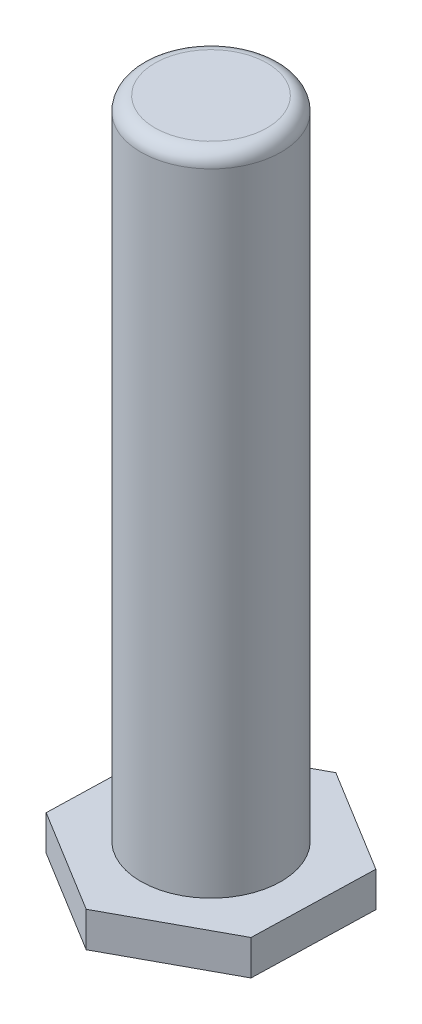
ISO-10303-21;
HEADER;
FILE_DESCRIPTION(('STEP AP214'),'2;1');
FILE_NAME('part.step','',(''),(''),'','','');
FILE_SCHEMA(('AUTOMOTIVE_DESIGN { 1 0 10303 214 1 1 1 1 }'));
ENDSEC;
DATA;
#1=APPLICATION_CONTEXT('core data for automotive mechanical design processes');
#2=APPLICATION_PROTOCOL_DEFINITION('international standard','automotive_design',2000,#1);
#3=PRODUCT_CONTEXT('',#1,'mechanical');
#4=PRODUCT('Part','Part','',(#3));
#5=PRODUCT_RELATED_PRODUCT_CATEGORY('part','',(#4));
#6=PRODUCT_DEFINITION_FORMATION('','',#4);
#7=PRODUCT_DEFINITION_CONTEXT('part definition',#1,'design');
#8=PRODUCT_DEFINITION('design','',#6,#7);
#9=PRODUCT_DEFINITION_SHAPE('','',#8);
#10=(LENGTH_UNIT() NAMED_UNIT(*) SI_UNIT(.MILLI.,.METRE.));
#11=(NAMED_UNIT(*) PLANE_ANGLE_UNIT() SI_UNIT($,.RADIAN.));
#12=(NAMED_UNIT(*) SI_UNIT($,.STERADIAN.) SOLID_ANGLE_UNIT());
#13=UNCERTAINTY_MEASURE_WITH_UNIT(LENGTH_MEASURE(1.E-05),#10,'distance_accuracy_value','');
#14=(GEOMETRIC_REPRESENTATION_CONTEXT(3) GLOBAL_UNCERTAINTY_ASSIGNED_CONTEXT((#13)) GLOBAL_UNIT_ASSIGNED_CONTEXT((#10,
#11,#12)) REPRESENTATION_CONTEXT('',''));
#15=CARTESIAN_POINT('',(0.,0.,0.));
#16=DIRECTION('',(0.,0.,1.));
#17=DIRECTION('',(1.,0.,0.));
#18=AXIS2_PLACEMENT_3D('',#15,#16,#17);
#19=CARTESIAN_POINT('',(0.464078435847936,5.,-17.3205080756888));
#20=DIRECTION('',(0.476625025306334,0.,0.879106697307976));
#21=DIRECTION('',(0.879106697307976,0.,-0.476625025306334));
#22=AXIS2_PLACEMENT_3D('',#19,#20,#21);
#23=PLANE('',#22);
#24=DIRECTION('',(-0.879106697307976,0.,0.476625025306334));
#25=VECTOR('',#24,1.);
#26=CARTESIAN_POINT('',(0.464078435847936,0.,-17.3205080756888));
#27=LINE('',#26,#25);
#28=CARTESIAN_POINT('',(0.464078435847936,0.,-17.3205080756888));
#29=VERTEX_POINT('',#28);
#30=CARTESIAN_POINT('',(-14.767960782076,0.,-9.06215775263725));
#31=VERTEX_POINT('',#30);
#32=EDGE_CURVE('E122',#29,#31,#27,.T.);
#33=ORIENTED_EDGE('',*,*,#32,.T.);
#34=DIRECTION('',(0.,-1.,0.));
#35=VECTOR('',#34,1.);
#36=CARTESIAN_POINT('',(-14.767960782076,5.,-9.06215775263725));
#37=LINE('',#36,#35);
#38=CARTESIAN_POINT('',(-14.767960782076,5.,-9.06215775263725));
#39=VERTEX_POINT('',#38);
#40=EDGE_CURVE('E139',#39,#31,#37,.T.);
#41=ORIENTED_EDGE('',*,*,#40,.F.);
#42=DIRECTION('',(-0.879106697307976,0.,0.476625025306334));
#43=VECTOR('',#42,1.);
#44=CARTESIAN_POINT('',(0.464078435847936,5.,-17.3205080756888));
#45=LINE('',#44,#43);
#46=CARTESIAN_POINT('',(0.464078435847936,5.,-17.3205080756888));
#47=VERTEX_POINT('',#46);
#48=EDGE_CURVE('E132',#47,#39,#45,.T.);
#49=ORIENTED_EDGE('',*,*,#48,.F.);
#50=DIRECTION('',(0.,-1.,0.));
#51=VECTOR('',#50,1.);
#52=CARTESIAN_POINT('',(0.464078435847936,5.,-17.3205080756888));
#53=LINE('',#52,#51);
#54=EDGE_CURVE('E118',#47,#29,#53,.T.);
#55=ORIENTED_EDGE('',*,*,#54,.T.);
#56=EDGE_LOOP('',(#33,#41,#49,#55));
#57=FACE_BOUND('',#56,.T.);
#58=ADVANCED_FACE('F36',(#57),#23,.F.);
#59=CARTESIAN_POINT('',(-14.767960782076,5.,-9.06215775263725));
#60=DIRECTION('',(0.999641245158911,0.,0.0267839686593015));
#61=DIRECTION('',(0.0267839686593015,0.,-0.999641245158911));
#62=AXIS2_PLACEMENT_3D('',#59,#60,#61);
#63=PLANE('',#62);
#64=DIRECTION('',(-0.0267839686593015,0.,0.999641245158911));
#65=VECTOR('',#64,1.);
#66=CARTESIAN_POINT('',(-14.767960782076,0.,-9.06215775263725));
#67=LINE('',#66,#65);
#68=CARTESIAN_POINT('',(-15.232039217924,0.,8.25835032305153));
#69=VERTEX_POINT('',#68);
#70=EDGE_CURVE('E125',#31,#69,#67,.T.);
#71=ORIENTED_EDGE('',*,*,#70,.T.);
#72=DIRECTION('',(0.,-1.,0.));
#73=VECTOR('',#72,1.);
#74=CARTESIAN_POINT('',(-15.232039217924,5.,8.25835032305153));
#75=LINE('',#74,#73);
#76=CARTESIAN_POINT('',(-15.232039217924,5.,8.25835032305153));
#77=VERTEX_POINT('',#76);
#78=EDGE_CURVE('E136',#77,#69,#75,.T.);
#79=ORIENTED_EDGE('',*,*,#78,.F.);
#80=DIRECTION('',(-0.0267839686593015,0.,0.999641245158911));
#81=VECTOR('',#80,1.);
#82=CARTESIAN_POINT('',(-14.767960782076,5.,-9.06215775263725));
#83=LINE('',#82,#81);
#84=EDGE_CURVE('E91',#39,#77,#83,.T.);
#85=ORIENTED_EDGE('',*,*,#84,.F.);
#86=ORIENTED_EDGE('',*,*,#40,.T.);
#87=EDGE_LOOP('',(#71,#79,#85,#86));
#88=FACE_BOUND('',#87,.T.);
#89=ADVANCED_FACE('F152',(#88),#63,.F.);
#90=CARTESIAN_POINT('',(-15.232039217924,5.,8.25835032305153));
#91=DIRECTION('',(0.523016219852577,0.,-0.852322728648674));
#92=DIRECTION('',(-0.852322728648674,0.,-0.523016219852577));
#93=AXIS2_PLACEMENT_3D('',#90,#91,#92);
#94=PLANE('',#93);
#95=DIRECTION('',(0.852322728648674,0.,0.523016219852577));
#96=VECTOR('',#95,1.);
#97=CARTESIAN_POINT('',(-15.232039217924,0.,8.25835032305153));
#98=LINE('',#97,#96);
#99=CARTESIAN_POINT('',(-0.464078435847931,0.,17.3205080756888));
#100=VERTEX_POINT('',#99);
#101=EDGE_CURVE('E127',#69,#100,#98,.T.);
#102=ORIENTED_EDGE('',*,*,#101,.T.);
#103=DIRECTION('',(0.,-1.,0.));
#104=VECTOR('',#103,1.);
#105=CARTESIAN_POINT('',(-0.464078435847931,5.,17.3205080756888));
#106=LINE('',#105,#104);
#107=CARTESIAN_POINT('',(-0.464078435847931,5.,17.3205080756888));
#108=VERTEX_POINT('',#107);
#109=EDGE_CURVE('E113',#108,#100,#106,.T.);
#110=ORIENTED_EDGE('',*,*,#109,.F.);
#111=DIRECTION('',(0.852322728648674,0.,0.523016219852577));
#112=VECTOR('',#111,1.);
#113=CARTESIAN_POINT('',(-15.232039217924,5.,8.25835032305153));
#114=LINE('',#113,#112);
#115=EDGE_CURVE('E104',#77,#108,#114,.T.);
#116=ORIENTED_EDGE('',*,*,#115,.F.);
#117=ORIENTED_EDGE('',*,*,#78,.T.);
#118=EDGE_LOOP('',(#102,#110,#116,#117));
#119=FACE_BOUND('',#118,.T.);
#120=ADVANCED_FACE('F155',(#119),#94,.F.);
#121=CARTESIAN_POINT('',(-0.464078435847931,5.,17.3205080756888));
#122=DIRECTION('',(-0.476625025306334,0.,-0.879106697307976));
#123=DIRECTION('',(-0.879106697307976,0.,0.476625025306334));
#124=AXIS2_PLACEMENT_3D('',#121,#122,#123);
#125=PLANE('',#124);
#126=DIRECTION('',(0.879106697307976,0.,-0.476625025306334));
#127=VECTOR('',#126,1.);
#128=CARTESIAN_POINT('',(-0.464078435847931,0.,17.3205080756888));
#129=LINE('',#128,#127);
#130=CARTESIAN_POINT('',(14.767960782076,0.,9.06215775263725));
#131=VERTEX_POINT('',#130);
#132=EDGE_CURVE('E112',#100,#131,#129,.T.);
#133=ORIENTED_EDGE('',*,*,#132,.T.);
#134=DIRECTION('',(0.,-1.,0.));
#135=VECTOR('',#134,1.);
#136=CARTESIAN_POINT('',(14.767960782076,5.,9.06215775263725));
#137=LINE('',#136,#135);
#138=CARTESIAN_POINT('',(14.767960782076,5.,9.06215775263725));
#139=VERTEX_POINT('',#138);
#140=EDGE_CURVE('E109',#139,#131,#137,.T.);
#141=ORIENTED_EDGE('',*,*,#140,.F.);
#142=DIRECTION('',(0.879106697307976,0.,-0.476625025306334));
#143=VECTOR('',#142,1.);
#144=CARTESIAN_POINT('',(-0.464078435847931,5.,17.3205080756888));
#145=LINE('',#144,#143);
#146=EDGE_CURVE('E98',#108,#139,#145,.T.);
#147=ORIENTED_EDGE('',*,*,#146,.F.);
#148=ORIENTED_EDGE('',*,*,#109,.T.);
#149=EDGE_LOOP('',(#133,#141,#147,#148));
#150=FACE_BOUND('',#149,.T.);
#151=ADVANCED_FACE('F110',(#150),#125,.F.);
#152=CARTESIAN_POINT('',(14.767960782076,5.,9.06215775263725));
#153=DIRECTION('',(-0.999641245158911,0.,-0.0267839686593015));
#154=DIRECTION('',(-0.0267839686593015,0.,0.999641245158911));
#155=AXIS2_PLACEMENT_3D('',#152,#153,#154);
#156=PLANE('',#155);
#157=DIRECTION('',(0.0267839686593015,0.,-0.999641245158911));
#158=VECTOR('',#157,1.);
#159=CARTESIAN_POINT('',(14.767960782076,0.,9.06215775263725));
#160=LINE('',#159,#158);
#161=CARTESIAN_POINT('',(15.232039217924,0.,-8.25835032305153));
#162=VERTEX_POINT('',#161);
#163=EDGE_CURVE('E76',#131,#162,#160,.T.);
#164=ORIENTED_EDGE('',*,*,#163,.T.);
#165=DIRECTION('',(0.,-1.,0.));
#166=VECTOR('',#165,1.);
#167=CARTESIAN_POINT('',(15.232039217924,5.,-8.25835032305153));
#168=LINE('',#167,#166);
#169=CARTESIAN_POINT('',(15.232039217924,5.,-8.25835032305153));
#170=VERTEX_POINT('',#169);
#171=EDGE_CURVE('E114',#170,#162,#168,.T.);
#172=ORIENTED_EDGE('',*,*,#171,.F.);
#173=DIRECTION('',(0.0267839686593015,0.,-0.999641245158911));
#174=VECTOR('',#173,1.);
#175=CARTESIAN_POINT('',(14.767960782076,5.,9.06215775263725));
#176=LINE('',#175,#174);
#177=EDGE_CURVE('E102',#139,#170,#176,.T.);
#178=ORIENTED_EDGE('',*,*,#177,.F.);
#179=ORIENTED_EDGE('',*,*,#140,.T.);
#180=EDGE_LOOP('',(#164,#172,#178,#179));
#181=FACE_BOUND('',#180,.T.);
#182=ADVANCED_FACE('F116',(#181),#156,.F.);
#183=CARTESIAN_POINT('',(15.232039217924,5.,-8.25835032305153));
#184=DIRECTION('',(-0.523016219852577,0.,0.852322728648674));
#185=DIRECTION('',(0.852322728648674,0.,0.523016219852577));
#186=AXIS2_PLACEMENT_3D('',#183,#184,#185);
#187=PLANE('',#186);
#188=DIRECTION('',(-0.852322728648674,0.,-0.523016219852577));
#189=VECTOR('',#188,1.);
#190=CARTESIAN_POINT('',(15.232039217924,0.,-8.25835032305153));
#191=LINE('',#190,#189);
#192=EDGE_CURVE('E82',#162,#29,#191,.T.);
#193=ORIENTED_EDGE('',*,*,#192,.T.);
#194=ORIENTED_EDGE('',*,*,#54,.F.);
#195=DIRECTION('',(-0.852322728648674,0.,-0.523016219852577));
#196=VECTOR('',#195,1.);
#197=CARTESIAN_POINT('',(15.232039217924,5.,-8.25835032305153));
#198=LINE('',#197,#196);
#199=EDGE_CURVE('E53',#170,#47,#198,.T.);
#200=ORIENTED_EDGE('',*,*,#199,.F.);
#201=ORIENTED_EDGE('',*,*,#171,.T.);
#202=EDGE_LOOP('',(#193,#194,#200,#201));
#203=FACE_BOUND('',#202,.T.);
#204=ADVANCED_FACE('F160',(#203),#187,.F.);
#205=CARTESIAN_POINT('',(0.,5.,0.));
#206=DIRECTION('',(0.,1.,0.));
#207=DIRECTION('',(0.,0.,1.));
#208=AXIS2_PLACEMENT_3D('',#205,#206,#207);
#209=PLANE('',#208);
#210=CARTESIAN_POINT('',(0.,5.,0.));
#211=DIRECTION('',(0.,1.,0.));
#212=DIRECTION('',(0.,0.,1.));
#213=AXIS2_PLACEMENT_3D('',#210,#211,#212);
#214=CIRCLE('',#213,10.);
#215=CARTESIAN_POINT('',(0.,5.,10.));
#216=VERTEX_POINT('',#215);
#217=EDGE_CURVE('E140',#216,#216,#214,.T.);
#218=ORIENTED_EDGE('',*,*,#217,.F.);
#219=EDGE_LOOP('',(#218));
#220=FACE_BOUND('',#219,.T.);
#221=ORIENTED_EDGE('',*,*,#48,.T.);
#222=ORIENTED_EDGE('',*,*,#84,.T.);
#223=ORIENTED_EDGE('',*,*,#115,.T.);
#224=ORIENTED_EDGE('',*,*,#146,.T.);
#225=ORIENTED_EDGE('',*,*,#177,.T.);
#226=ORIENTED_EDGE('',*,*,#199,.T.);
#227=EDGE_LOOP('',(#221,#222,#223,#224,#225,#226));
#228=FACE_BOUND('',#227,.T.);
#229=ADVANCED_FACE('F100',(#220,#228),#209,.T.);
#230=CARTESIAN_POINT('',(0.,0.,0.));
#231=DIRECTION('',(0.,1.,0.));
#232=DIRECTION('',(0.,0.,1.));
#233=AXIS2_PLACEMENT_3D('',#230,#231,#232);
#234=PLANE('',#233);
#235=ORIENTED_EDGE('',*,*,#32,.F.);
#236=ORIENTED_EDGE('',*,*,#192,.F.);
#237=ORIENTED_EDGE('',*,*,#163,.F.);
#238=ORIENTED_EDGE('',*,*,#132,.F.);
#239=ORIENTED_EDGE('',*,*,#101,.F.);
#240=ORIENTED_EDGE('',*,*,#70,.F.);
#241=EDGE_LOOP('',(#235,#236,#237,#238,#239,#240));
#242=FACE_BOUND('',#241,.T.);
#243=ADVANCED_FACE('F158',(#242),#234,.F.);
#244=CARTESIAN_POINT('',(0.,97.,0.));
#245=DIRECTION('',(0.,-1.,0.));
#246=DIRECTION('',(0.,0.,-1.));
#247=AXIS2_PLACEMENT_3D('',#244,#245,#246);
#248=CYLINDRICAL_SURFACE('',#247,10.);
#249=CARTESIAN_POINT('',(0.,95.,0.));
#250=DIRECTION('',(0.,1.,0.));
#251=DIRECTION('',(0.,0.,1.));
#252=AXIS2_PLACEMENT_3D('',#249,#250,#251);
#253=CIRCLE('',#252,10.);
#254=CARTESIAN_POINT('',(0.,95.,10.));
#255=VERTEX_POINT('',#254);
#256=EDGE_CURVE('E11',#255,#255,#253,.F.);
#257=ORIENTED_EDGE('',*,*,#256,.T.);
#258=EDGE_LOOP('',(#257));
#259=FACE_BOUND('',#258,.T.);
#260=ORIENTED_EDGE('',*,*,#217,.T.);
#261=EDGE_LOOP('',(#260));
#262=FACE_BOUND('',#261,.T.);
#263=ADVANCED_FACE('F202',(#259,#262),#248,.T.);
#264=CARTESIAN_POINT('',(0.,97.,0.));
#265=DIRECTION('',(0.,1.,0.));
#266=DIRECTION('',(0.,0.,1.));
#267=AXIS2_PLACEMENT_3D('',#264,#265,#266);
#268=PLANE('',#267);
#269=CARTESIAN_POINT('',(0.,97.,0.));
#270=DIRECTION('',(0.,1.,0.));
#271=DIRECTION('',(0.,0.,1.));
#272=AXIS2_PLACEMENT_3D('',#269,#270,#271);
#273=CIRCLE('',#272,8.);
#274=CARTESIAN_POINT('',(0.,97.,8.));
#275=VERTEX_POINT('',#274);
#276=EDGE_CURVE('E45',#275,#275,#273,.T.);
#277=ORIENTED_EDGE('',*,*,#276,.T.);
#278=EDGE_LOOP('',(#277));
#279=FACE_BOUND('',#278,.T.);
#280=ADVANCED_FACE('F216',(#279),#268,.T.);
#281=CARTESIAN_POINT('',(0.,95.,0.));
#282=DIRECTION('',(0.,1.,0.));
#283=DIRECTION('',(0.,0.,1.));
#284=AXIS2_PLACEMENT_3D('',#281,#282,#283);
#285=TOROIDAL_SURFACE('',#284,8.,2.);
#286=ORIENTED_EDGE('',*,*,#256,.F.);
#287=EDGE_LOOP('',(#286));
#288=FACE_BOUND('',#287,.T.);
#289=ORIENTED_EDGE('',*,*,#276,.F.);
#290=EDGE_LOOP('',(#289));
#291=FACE_BOUND('',#290,.T.);
#292=ADVANCED_FACE('F38',(#288,#291),#285,.T.);
#293=CLOSED_SHELL('',(#58,#89,#120,#151,#182,#204,#229,#243,#263,#280,#292));
#294=MANIFOLD_SOLID_BREP('B2',#293);
#295=ADVANCED_BREP_SHAPE_REPRESENTATION('',(#18,#294),#14);
#296=SHAPE_DEFINITION_REPRESENTATION(#9,#295);
ENDSEC;
END-ISO-10303-21;
